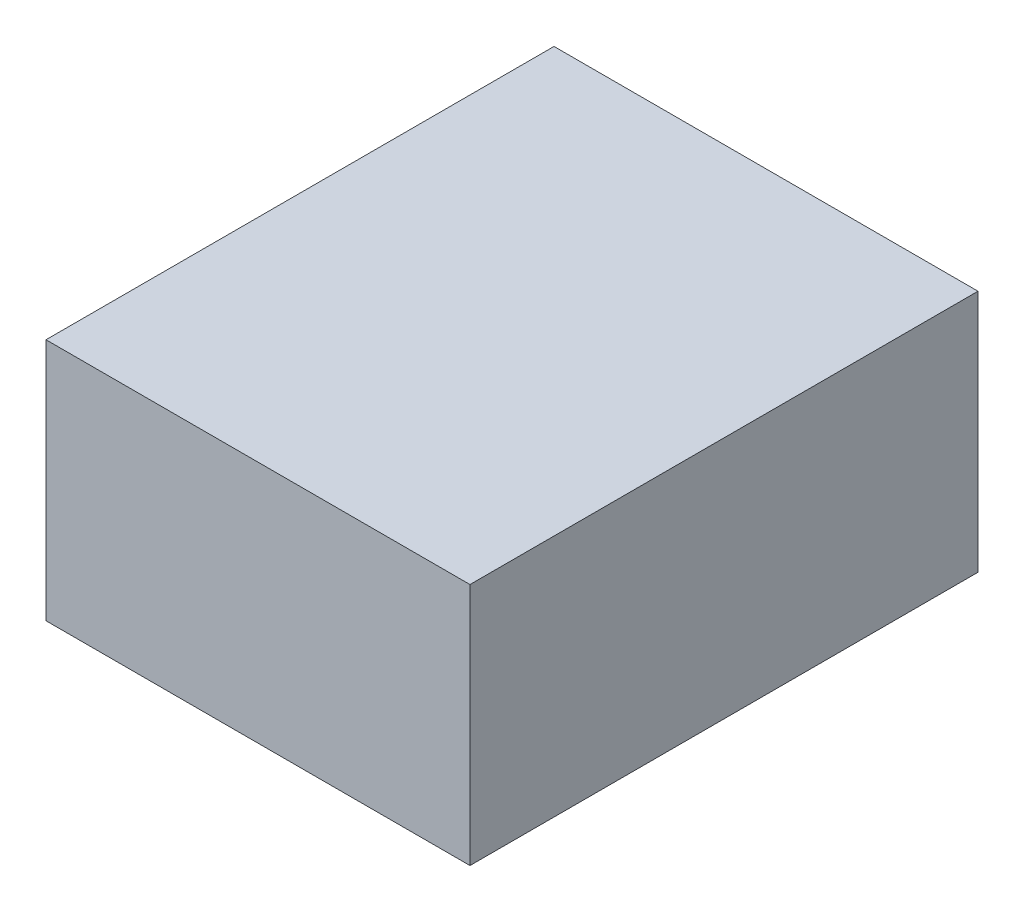
ISO-10303-21;
HEADER;
FILE_DESCRIPTION(('STEP AP214'),'2;1');
FILE_NAME('part.step','',(''),(''),'','','');
FILE_SCHEMA(('AUTOMOTIVE_DESIGN { 1 0 10303 214 1 1 1 1 }'));
ENDSEC;
DATA;
#1=APPLICATION_CONTEXT('core data for automotive mechanical design processes');
#2=APPLICATION_PROTOCOL_DEFINITION('international standard','automotive_design',2000,#1);
#3=PRODUCT_CONTEXT('',#1,'mechanical');
#4=PRODUCT('Part','Part','',(#3));
#5=PRODUCT_RELATED_PRODUCT_CATEGORY('part','',(#4));
#6=PRODUCT_DEFINITION_FORMATION('','',#4);
#7=PRODUCT_DEFINITION_CONTEXT('part definition',#1,'design');
#8=PRODUCT_DEFINITION('design','',#6,#7);
#9=PRODUCT_DEFINITION_SHAPE('','',#8);
#10=(LENGTH_UNIT() NAMED_UNIT(*) SI_UNIT(.MILLI.,.METRE.));
#11=(NAMED_UNIT(*) PLANE_ANGLE_UNIT() SI_UNIT($,.RADIAN.));
#12=(NAMED_UNIT(*) SI_UNIT($,.STERADIAN.) SOLID_ANGLE_UNIT());
#13=UNCERTAINTY_MEASURE_WITH_UNIT(LENGTH_MEASURE(1.E-05),#10,'distance_accuracy_value','');
#14=(GEOMETRIC_REPRESENTATION_CONTEXT(3) GLOBAL_UNCERTAINTY_ASSIGNED_CONTEXT((#13)) GLOBAL_UNIT_ASSIGNED_CONTEXT((#10,
#11,#12)) REPRESENTATION_CONTEXT('',''));
#15=CARTESIAN_POINT('',(0.,0.,0.));
#16=DIRECTION('',(0.,0.,1.));
#17=DIRECTION('',(1.,0.,0.));
#18=AXIS2_PLACEMENT_3D('',#15,#16,#17);
#19=CARTESIAN_POINT('',(-43.5491624573956,50.,52.18215510871));
#20=DIRECTION('',(1.,0.,0.));
#21=DIRECTION('',(0.,0.,-1.));
#22=AXIS2_PLACEMENT_3D('',#19,#20,#21);
#23=PLANE('',#22);
#24=DIRECTION('',(0.,0.,1.));
#25=VECTOR('',#24,1.);
#26=CARTESIAN_POINT('',(-43.5491624573956,0.,52.18215510871));
#27=LINE('',#26,#25);
#28=CARTESIAN_POINT('',(-43.5491624573956,0.,-52.18215510871));
#29=VERTEX_POINT('',#28);
#30=CARTESIAN_POINT('',(-43.5491624573956,0.,52.18215510871));
#31=VERTEX_POINT('',#30);
#32=EDGE_CURVE('E96',#29,#31,#27,.T.);
#33=ORIENTED_EDGE('',*,*,#32,.T.);
#34=DIRECTION('',(0.,-1.,0.));
#35=VECTOR('',#34,1.);
#36=CARTESIAN_POINT('',(-43.5491624573956,50.,52.18215510871));
#37=LINE('',#36,#35);
#38=CARTESIAN_POINT('',(-43.5491624573956,50.,52.18215510871));
#39=VERTEX_POINT('',#38);
#40=EDGE_CURVE('E11',#39,#31,#37,.T.);
#41=ORIENTED_EDGE('',*,*,#40,.F.);
#42=DIRECTION('',(0.,0.,1.));
#43=VECTOR('',#42,1.);
#44=CARTESIAN_POINT('',(-43.5491624573956,50.,52.18215510871));
#45=LINE('',#44,#43);
#46=CARTESIAN_POINT('',(-43.5491624573956,50.,-52.18215510871));
#47=VERTEX_POINT('',#46);
#48=EDGE_CURVE('E84',#47,#39,#45,.T.);
#49=ORIENTED_EDGE('',*,*,#48,.F.);
#50=DIRECTION('',(0.,-1.,0.));
#51=VECTOR('',#50,1.);
#52=CARTESIAN_POINT('',(-43.5491624573956,50.,-52.18215510871));
#53=LINE('',#52,#51);
#54=EDGE_CURVE('E92',#47,#29,#53,.T.);
#55=ORIENTED_EDGE('',*,*,#54,.T.);
#56=EDGE_LOOP('',(#33,#41,#49,#55));
#57=FACE_BOUND('',#56,.T.);
#58=ADVANCED_FACE('F33',(#57),#23,.F.);
#59=CARTESIAN_POINT('',(43.5491624573956,50.,52.18215510871));
#60=DIRECTION('',(0.,0.,-1.));
#61=DIRECTION('',(-1.,0.,0.));
#62=AXIS2_PLACEMENT_3D('',#59,#60,#61);
#63=PLANE('',#62);
#64=DIRECTION('',(1.,0.,0.));
#65=VECTOR('',#64,1.);
#66=CARTESIAN_POINT('',(43.5491624573956,0.,52.18215510871));
#67=LINE('',#66,#65);
#68=CARTESIAN_POINT('',(43.5491624573956,0.,52.18215510871));
#69=VERTEX_POINT('',#68);
#70=EDGE_CURVE('E88',#31,#69,#67,.T.);
#71=ORIENTED_EDGE('',*,*,#70,.T.);
#72=DIRECTION('',(0.,-1.,0.));
#73=VECTOR('',#72,1.);
#74=CARTESIAN_POINT('',(43.5491624573956,50.,52.18215510871));
#75=LINE('',#74,#73);
#76=CARTESIAN_POINT('',(43.5491624573956,50.,52.18215510871));
#77=VERTEX_POINT('',#76);
#78=EDGE_CURVE('E41',#77,#69,#75,.T.);
#79=ORIENTED_EDGE('',*,*,#78,.F.);
#80=DIRECTION('',(1.,0.,0.));
#81=VECTOR('',#80,1.);
#82=CARTESIAN_POINT('',(43.5491624573956,50.,52.18215510871));
#83=LINE('',#82,#81);
#84=EDGE_CURVE('E79',#39,#77,#83,.T.);
#85=ORIENTED_EDGE('',*,*,#84,.F.);
#86=ORIENTED_EDGE('',*,*,#40,.T.);
#87=EDGE_LOOP('',(#71,#79,#85,#86));
#88=FACE_BOUND('',#87,.T.);
#89=ADVANCED_FACE('F87',(#88),#63,.F.);
#90=CARTESIAN_POINT('',(43.5491624573956,50.,52.18215510871));
#91=DIRECTION('',(-1.,0.,0.));
#92=DIRECTION('',(0.,0.,1.));
#93=AXIS2_PLACEMENT_3D('',#90,#91,#92);
#94=PLANE('',#93);
#95=DIRECTION('',(0.,0.,-1.));
#96=VECTOR('',#95,1.);
#97=CARTESIAN_POINT('',(43.5491624573956,0.,52.18215510871));
#98=LINE('',#97,#96);
#99=CARTESIAN_POINT('',(43.5491624573956,0.,-52.18215510871));
#100=VERTEX_POINT('',#99);
#101=EDGE_CURVE('E66',#69,#100,#98,.T.);
#102=ORIENTED_EDGE('',*,*,#101,.T.);
#103=DIRECTION('',(0.,-1.,0.));
#104=VECTOR('',#103,1.);
#105=CARTESIAN_POINT('',(43.5491624573956,50.,-52.18215510871));
#106=LINE('',#105,#104);
#107=CARTESIAN_POINT('',(43.5491624573956,50.,-52.18215510871));
#108=VERTEX_POINT('',#107);
#109=EDGE_CURVE('E89',#108,#100,#106,.T.);
#110=ORIENTED_EDGE('',*,*,#109,.F.);
#111=DIRECTION('',(0.,0.,-1.));
#112=VECTOR('',#111,1.);
#113=CARTESIAN_POINT('',(43.5491624573956,50.,52.18215510871));
#114=LINE('',#113,#112);
#115=EDGE_CURVE('E82',#77,#108,#114,.T.);
#116=ORIENTED_EDGE('',*,*,#115,.F.);
#117=ORIENTED_EDGE('',*,*,#78,.T.);
#118=EDGE_LOOP('',(#102,#110,#116,#117));
#119=FACE_BOUND('',#118,.T.);
#120=ADVANCED_FACE('F90',(#119),#94,.F.);
#121=CARTESIAN_POINT('',(43.5491624573956,50.,-52.18215510871));
#122=DIRECTION('',(0.,0.,1.));
#123=DIRECTION('',(1.,0.,0.));
#124=AXIS2_PLACEMENT_3D('',#121,#122,#123);
#125=PLANE('',#124);
#126=DIRECTION('',(-1.,0.,0.));
#127=VECTOR('',#126,1.);
#128=CARTESIAN_POINT('',(43.5491624573956,0.,-52.18215510871));
#129=LINE('',#128,#127);
#130=EDGE_CURVE('E72',#100,#29,#129,.T.);
#131=ORIENTED_EDGE('',*,*,#130,.T.);
#132=ORIENTED_EDGE('',*,*,#54,.F.);
#133=DIRECTION('',(-1.,0.,0.));
#134=VECTOR('',#133,1.);
#135=CARTESIAN_POINT('',(43.5491624573956,50.,-52.18215510871));
#136=LINE('',#135,#134);
#137=EDGE_CURVE('E49',#108,#47,#136,.T.);
#138=ORIENTED_EDGE('',*,*,#137,.F.);
#139=ORIENTED_EDGE('',*,*,#109,.T.);
#140=EDGE_LOOP('',(#131,#132,#138,#139));
#141=FACE_BOUND('',#140,.T.);
#142=ADVANCED_FACE('F103',(#141),#125,.F.);
#143=CARTESIAN_POINT('',(0.,50.,0.));
#144=DIRECTION('',(0.,1.,0.));
#145=DIRECTION('',(0.,0.,1.));
#146=AXIS2_PLACEMENT_3D('',#143,#144,#145);
#147=PLANE('',#146);
#148=ORIENTED_EDGE('',*,*,#48,.T.);
#149=ORIENTED_EDGE('',*,*,#84,.T.);
#150=ORIENTED_EDGE('',*,*,#115,.T.);
#151=ORIENTED_EDGE('',*,*,#137,.T.);
#152=EDGE_LOOP('',(#148,#149,#150,#151));
#153=FACE_BOUND('',#152,.T.);
#154=ADVANCED_FACE('F80',(#153),#147,.T.);
#155=CARTESIAN_POINT('',(0.,0.,0.));
#156=DIRECTION('',(0.,1.,0.));
#157=DIRECTION('',(0.,0.,1.));
#158=AXIS2_PLACEMENT_3D('',#155,#156,#157);
#159=PLANE('',#158);
#160=ORIENTED_EDGE('',*,*,#32,.F.);
#161=ORIENTED_EDGE('',*,*,#130,.F.);
#162=ORIENTED_EDGE('',*,*,#101,.F.);
#163=ORIENTED_EDGE('',*,*,#70,.F.);
#164=EDGE_LOOP('',(#160,#161,#162,#163));
#165=FACE_BOUND('',#164,.T.);
#166=ADVANCED_FACE('F106',(#165),#159,.F.);
#167=CLOSED_SHELL('',(#58,#89,#120,#142,#154,#166));
#168=MANIFOLD_SOLID_BREP('B2',#167);
#169=ADVANCED_BREP_SHAPE_REPRESENTATION('',(#18,#168),#14);
#170=SHAPE_DEFINITION_REPRESENTATION(#9,#169);
ENDSEC;
END-ISO-10303-21;
